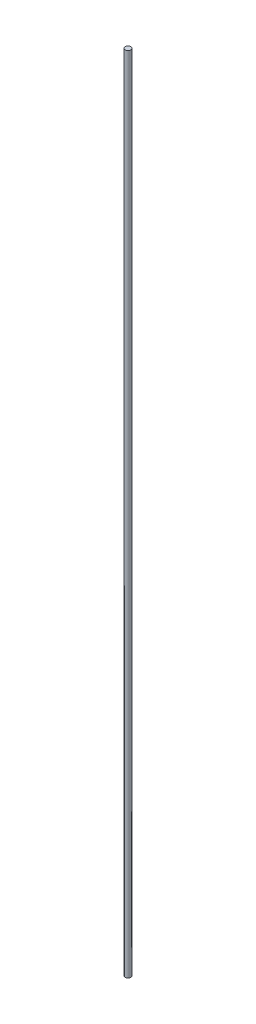
ISO-10303-21;
HEADER;
FILE_DESCRIPTION(('STEP AP214'),'2;1');
FILE_NAME('part.step','',(''),(''),'','','');
FILE_SCHEMA(('AUTOMOTIVE_DESIGN { 1 0 10303 214 1 1 1 1 }'));
ENDSEC;
DATA;
#1=APPLICATION_CONTEXT('core data for automotive mechanical design processes');
#2=APPLICATION_PROTOCOL_DEFINITION('international standard','automotive_design',2000,#1);
#3=PRODUCT_CONTEXT('',#1,'mechanical');
#4=PRODUCT('Part','Part','',(#3));
#5=PRODUCT_RELATED_PRODUCT_CATEGORY('part','',(#4));
#6=PRODUCT_DEFINITION_FORMATION('','',#4);
#7=PRODUCT_DEFINITION_CONTEXT('part definition',#1,'design');
#8=PRODUCT_DEFINITION('design','',#6,#7);
#9=PRODUCT_DEFINITION_SHAPE('','',#8);
#10=(LENGTH_UNIT() NAMED_UNIT(*) SI_UNIT(.MILLI.,.METRE.));
#11=(NAMED_UNIT(*) PLANE_ANGLE_UNIT() SI_UNIT($,.RADIAN.));
#12=(NAMED_UNIT(*) SI_UNIT($,.STERADIAN.) SOLID_ANGLE_UNIT());
#13=UNCERTAINTY_MEASURE_WITH_UNIT(LENGTH_MEASURE(1.E-05),#10,'distance_accuracy_value','');
#14=(GEOMETRIC_REPRESENTATION_CONTEXT(3) GLOBAL_UNCERTAINTY_ASSIGNED_CONTEXT((#13)) GLOBAL_UNIT_ASSIGNED_CONTEXT((#10,
#11,#12)) REPRESENTATION_CONTEXT('',''));
#15=CARTESIAN_POINT('',(0.,0.,0.));
#16=DIRECTION('',(0.,0.,1.));
#17=DIRECTION('',(1.,0.,0.));
#18=AXIS2_PLACEMENT_3D('',#15,#16,#17);
#19=CARTESIAN_POINT('',(0.,424.,0.));
#20=DIRECTION('',(0.,-1.,0.));
#21=DIRECTION('',(0.,0.,-1.));
#22=AXIS2_PLACEMENT_3D('',#19,#20,#21);
#23=CYLINDRICAL_SURFACE('',#22,1.5);
#24=CARTESIAN_POINT('',(0.,424.,0.));
#25=DIRECTION('',(0.,1.,0.));
#26=DIRECTION('',(0.,0.,1.));
#27=AXIS2_PLACEMENT_3D('',#24,#25,#26);
#28=CIRCLE('',#27,1.5);
#29=CARTESIAN_POINT('',(0.,424.,1.5));
#30=VERTEX_POINT('',#29);
#31=EDGE_CURVE('E10',#30,#30,#28,.T.);
#32=ORIENTED_EDGE('',*,*,#31,.F.);
#33=EDGE_LOOP('',(#32));
#34=FACE_BOUND('',#33,.T.);
#35=CARTESIAN_POINT('',(0.,0.,0.));
#36=DIRECTION('',(0.,1.,0.));
#37=DIRECTION('',(0.,0.,1.));
#38=AXIS2_PLACEMENT_3D('',#35,#36,#37);
#39=CIRCLE('',#38,1.5);
#40=CARTESIAN_POINT('',(0.,0.,1.5));
#41=VERTEX_POINT('',#40);
#42=EDGE_CURVE('E44',#41,#41,#39,.T.);
#43=ORIENTED_EDGE('',*,*,#42,.T.);
#44=EDGE_LOOP('',(#43));
#45=FACE_BOUND('',#44,.T.);
#46=ADVANCED_FACE('F41',(#34,#45),#23,.T.);
#47=CARTESIAN_POINT('',(0.,424.,0.));
#48=DIRECTION('',(0.,1.,0.));
#49=DIRECTION('',(0.,0.,1.));
#50=AXIS2_PLACEMENT_3D('',#47,#48,#49);
#51=PLANE('',#50);
#52=ORIENTED_EDGE('',*,*,#31,.T.);
#53=EDGE_LOOP('',(#52));
#54=FACE_BOUND('',#53,.T.);
#55=ADVANCED_FACE('F56',(#54),#51,.T.);
#56=CARTESIAN_POINT('',(0.,0.,0.));
#57=DIRECTION('',(0.,1.,0.));
#58=DIRECTION('',(0.,0.,1.));
#59=AXIS2_PLACEMENT_3D('',#56,#57,#58);
#60=PLANE('',#59);
#61=ORIENTED_EDGE('',*,*,#42,.F.);
#62=EDGE_LOOP('',(#61));
#63=FACE_BOUND('',#62,.T.);
#64=ADVANCED_FACE('F54',(#63),#60,.F.);
#65=CLOSED_SHELL('',(#46,#55,#64));
#66=MANIFOLD_SOLID_BREP('B2',#65);
#67=ADVANCED_BREP_SHAPE_REPRESENTATION('',(#18,#66),#14);
#68=SHAPE_DEFINITION_REPRESENTATION(#9,#67);
ENDSEC;
END-ISO-10303-21;
